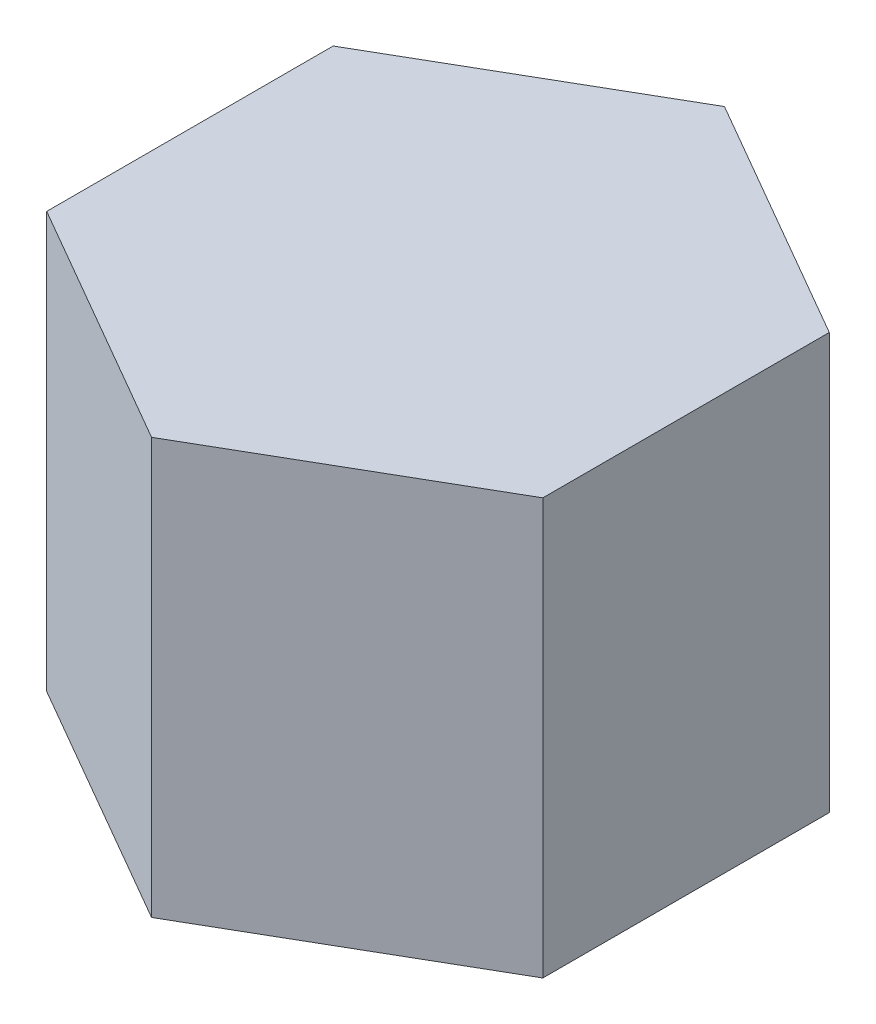
ISO-10303-21;
HEADER;
FILE_DESCRIPTION(('STEP AP214'),'2;1');
FILE_NAME('part.step','',(''),(''),'','','');
FILE_SCHEMA(('AUTOMOTIVE_DESIGN { 1 0 10303 214 1 1 1 1 }'));
ENDSEC;
DATA;
#1=APPLICATION_CONTEXT('core data for automotive mechanical design processes');
#2=APPLICATION_PROTOCOL_DEFINITION('international standard','automotive_design',2000,#1);
#3=PRODUCT_CONTEXT('',#1,'mechanical');
#4=PRODUCT('Part','Part','',(#3));
#5=PRODUCT_RELATED_PRODUCT_CATEGORY('part','',(#4));
#6=PRODUCT_DEFINITION_FORMATION('','',#4);
#7=PRODUCT_DEFINITION_CONTEXT('part definition',#1,'design');
#8=PRODUCT_DEFINITION('design','',#6,#7);
#9=PRODUCT_DEFINITION_SHAPE('','',#8);
#10=(LENGTH_UNIT() NAMED_UNIT(*) SI_UNIT(.MILLI.,.METRE.));
#11=(NAMED_UNIT(*) PLANE_ANGLE_UNIT() SI_UNIT($,.RADIAN.));
#12=(NAMED_UNIT(*) SI_UNIT($,.STERADIAN.) SOLID_ANGLE_UNIT());
#13=UNCERTAINTY_MEASURE_WITH_UNIT(LENGTH_MEASURE(1.E-05),#10,'distance_accuracy_value','');
#14=(GEOMETRIC_REPRESENTATION_CONTEXT(3) GLOBAL_UNCERTAINTY_ASSIGNED_CONTEXT((#13)) GLOBAL_UNIT_ASSIGNED_CONTEXT((#10,
#11,#12)) REPRESENTATION_CONTEXT('',''));
#15=CARTESIAN_POINT('',(0.,0.,0.));
#16=DIRECTION('',(0.,0.,1.));
#17=DIRECTION('',(1.,0.,0.));
#18=AXIS2_PLACEMENT_3D('',#15,#16,#17);
#19=CARTESIAN_POINT('',(205.142660308706,-148.537700895744,292.372996624279));
#20=DIRECTION('',(-0.499999999999909,0.,-0.866025403784491));
#21=DIRECTION('',(-0.866025403784491,0.,0.499999999999909));
#22=AXIS2_PLACEMENT_3D('',#19,#20,#21);
#23=PLANE('',#22);
#24=CARTESIAN_POINT('',(204.839551417382,-149.045793579175,292.547996624279));
#25=DIRECTION('',(0.866025403784491,0.,-0.499999999999909));
#26=VECTOR('',#25,1.);
#27=LINE('',#24,#26);
#28=CARTESIAN_POINT('',(204.839551417382,-149.045793579175,292.547996624279));
#29=VERTEX_POINT('',#28);
#30=CARTESIAN_POINT('',(205.142660308706,-149.045793579175,292.372996624279));
#31=VERTEX_POINT('',#30);
#32=EDGE_CURVE('E170',#29,#31,#27,.T.);
#33=ORIENTED_EDGE('',*,*,#32,.T.);
#34=CARTESIAN_POINT('',(205.142660308706,-148.537700895744,292.372996624279));
#35=DIRECTION('',(0.,-1.,0.));
#36=VECTOR('',#35,1.);
#37=LINE('',#34,#36);
#38=CARTESIAN_POINT('',(205.142660308706,-148.537700895744,292.372996624279));
#39=VERTEX_POINT('',#38);
#40=EDGE_CURVE('E35',#39,#31,#37,.T.);
#41=ORIENTED_EDGE('',*,*,#40,.F.);
#42=CARTESIAN_POINT('',(204.839551417382,-148.537700895744,292.547996624279));
#43=DIRECTION('',(0.866025403784491,0.,-0.499999999999909));
#44=VECTOR('',#43,1.);
#45=LINE('',#42,#44);
#46=CARTESIAN_POINT('',(204.839551417382,-148.537700895744,292.547996624279));
#47=VERTEX_POINT('',#46);
#48=EDGE_CURVE('E159',#47,#39,#45,.T.);
#49=ORIENTED_EDGE('',*,*,#48,.F.);
#50=CARTESIAN_POINT('',(204.839551417382,-148.537700895744,292.547996624279));
#51=DIRECTION('',(0.,-1.,0.));
#52=VECTOR('',#51,1.);
#53=LINE('',#50,#52);
#54=EDGE_CURVE('E10',#47,#29,#53,.T.);
#55=ORIENTED_EDGE('',*,*,#54,.T.);
#56=EDGE_LOOP('',(#33,#41,#49,#55));
#57=FACE_BOUND('',#56,.T.);
#58=ADVANCED_FACE('F16',(#57),#23,.F.);
#59=CARTESIAN_POINT('',(204.839551417382,-148.537700895744,292.547996624279));
#60=DIRECTION('',(0.500000000000062,0.,-0.866025403784403));
#61=DIRECTION('',(-0.866025403784403,0.,-0.500000000000062));
#62=AXIS2_PLACEMENT_3D('',#59,#60,#61);
#63=PLANE('',#62);
#64=CARTESIAN_POINT('',(204.536442526057,-149.045793579175,292.372996624279));
#65=DIRECTION('',(0.866025403784403,0.,0.500000000000062));
#66=VECTOR('',#65,1.);
#67=LINE('',#64,#66);
#68=CARTESIAN_POINT('',(204.536442526057,-149.045793579175,292.372996624279));
#69=VERTEX_POINT('',#68);
#70=EDGE_CURVE('E167',#69,#29,#67,.T.);
#71=ORIENTED_EDGE('',*,*,#70,.T.);
#72=ORIENTED_EDGE('',*,*,#54,.F.);
#73=CARTESIAN_POINT('',(204.536442526057,-148.537700895744,292.372996624279));
#74=DIRECTION('',(0.866025403784403,0.,0.500000000000062));
#75=VECTOR('',#74,1.);
#76=LINE('',#73,#75);
#77=CARTESIAN_POINT('',(204.536442526057,-148.537700895744,292.372996624279));
#78=VERTEX_POINT('',#77);
#79=EDGE_CURVE('E156',#78,#47,#76,.T.);
#80=ORIENTED_EDGE('',*,*,#79,.F.);
#81=CARTESIAN_POINT('',(204.536442526057,-148.537700895744,292.372996624279));
#82=DIRECTION('',(0.,-1.,0.));
#83=VECTOR('',#82,1.);
#84=LINE('',#81,#83);
#85=EDGE_CURVE('E27',#78,#69,#84,.T.);
#86=ORIENTED_EDGE('',*,*,#85,.T.);
#87=EDGE_LOOP('',(#71,#72,#80,#86));
#88=FACE_BOUND('',#87,.T.);
#89=ADVANCED_FACE('F189',(#88),#63,.F.);
#90=CARTESIAN_POINT('',(204.536442526057,-148.537700895744,290.831971220494));
#91=DIRECTION('',(1.,0.,0.));
#92=DIRECTION('',(0.,1.,0.));
#93=AXIS2_PLACEMENT_3D('',#90,#91,#92);
#94=PLANE('',#93);
#95=CARTESIAN_POINT('',(204.536442526057,-149.045793579175,292.022996624279));
#96=DIRECTION('',(0.,0.,1.));
#97=VECTOR('',#96,1.);
#98=LINE('',#95,#97);
#99=CARTESIAN_POINT('',(204.536442526057,-149.045793579175,292.022996624279));
#100=VERTEX_POINT('',#99);
#101=EDGE_CURVE('E163',#100,#69,#98,.T.);
#102=ORIENTED_EDGE('',*,*,#101,.T.);
#103=ORIENTED_EDGE('',*,*,#85,.F.);
#104=CARTESIAN_POINT('',(204.536442526057,-148.537700895744,292.022996624279));
#105=DIRECTION('',(0.,0.,1.));
#106=VECTOR('',#105,1.);
#107=LINE('',#104,#106);
#108=CARTESIAN_POINT('',(204.536442526057,-148.537700895744,292.022996624279));
#109=VERTEX_POINT('',#108);
#110=EDGE_CURVE('E106',#109,#78,#107,.T.);
#111=ORIENTED_EDGE('',*,*,#110,.F.);
#112=CARTESIAN_POINT('',(204.536442526057,-148.537700895744,292.022996624279));
#113=DIRECTION('',(0.,-1.,0.));
#114=VECTOR('',#113,1.);
#115=LINE('',#112,#114);
#116=EDGE_CURVE('E94',#109,#100,#115,.T.);
#117=ORIENTED_EDGE('',*,*,#116,.T.);
#118=EDGE_LOOP('',(#102,#103,#111,#117));
#119=FACE_BOUND('',#118,.T.);
#120=ADVANCED_FACE('F198',(#119),#94,.F.);
#121=CARTESIAN_POINT('',(204.536442526057,-148.537700895744,292.022996624279));
#122=DIRECTION('',(0.499999999999943,0.,0.866025403784472));
#123=DIRECTION('',(0.866025403784472,0.,-0.499999999999943));
#124=AXIS2_PLACEMENT_3D('',#121,#122,#123);
#125=PLANE('',#124);
#126=CARTESIAN_POINT('',(204.839551417382,-149.045793579175,291.847996624279));
#127=DIRECTION('',(-0.866025403784471,0.,0.499999999999943));
#128=VECTOR('',#127,1.);
#129=LINE('',#126,#128);
#130=CARTESIAN_POINT('',(204.839551417382,-149.045793579175,291.847996624279));
#131=VERTEX_POINT('',#130);
#132=EDGE_CURVE('E162',#131,#100,#129,.T.);
#133=ORIENTED_EDGE('',*,*,#132,.T.);
#134=ORIENTED_EDGE('',*,*,#116,.F.);
#135=CARTESIAN_POINT('',(204.839551417382,-148.537700895744,291.847996624279));
#136=DIRECTION('',(-0.866025403784471,0.,0.499999999999943));
#137=VECTOR('',#136,1.);
#138=LINE('',#135,#137);
#139=CARTESIAN_POINT('',(204.839551417382,-148.537700895744,291.847996624279));
#140=VERTEX_POINT('',#139);
#141=EDGE_CURVE('E98',#140,#109,#138,.T.);
#142=ORIENTED_EDGE('',*,*,#141,.F.);
#143=CARTESIAN_POINT('',(204.839551417382,-148.537700895744,291.847996624279));
#144=DIRECTION('',(0.,-1.,0.));
#145=VECTOR('',#144,1.);
#146=LINE('',#143,#145);
#147=EDGE_CURVE('E79',#140,#131,#146,.T.);
#148=ORIENTED_EDGE('',*,*,#147,.T.);
#149=EDGE_LOOP('',(#133,#134,#142,#148));
#150=FACE_BOUND('',#149,.T.);
#151=ADVANCED_FACE('F100',(#150),#125,.F.);
#152=CARTESIAN_POINT('',(204.839551417382,-148.537700895744,291.847996624279));
#153=DIRECTION('',(-0.500000000000096,0.,0.866025403784383));
#154=DIRECTION('',(0.866025403784383,0.,0.500000000000096));
#155=AXIS2_PLACEMENT_3D('',#152,#153,#154);
#156=PLANE('',#155);
#157=CARTESIAN_POINT('',(205.142660308706,-149.045793579175,292.022996624279));
#158=DIRECTION('',(-0.866025403784383,0.,-0.500000000000096));
#159=VECTOR('',#158,1.);
#160=LINE('',#157,#159);
#161=CARTESIAN_POINT('',(205.142660308706,-149.045793579175,292.022996624279));
#162=VERTEX_POINT('',#161);
#163=EDGE_CURVE('E88',#162,#131,#160,.T.);
#164=ORIENTED_EDGE('',*,*,#163,.T.);
#165=ORIENTED_EDGE('',*,*,#147,.F.);
#166=CARTESIAN_POINT('',(205.142660308706,-148.537700895744,292.022996624279));
#167=DIRECTION('',(-0.866025403784383,0.,-0.500000000000096));
#168=VECTOR('',#167,1.);
#169=LINE('',#166,#168);
#170=CARTESIAN_POINT('',(205.142660308706,-148.537700895744,292.022996624279));
#171=VERTEX_POINT('',#170);
#172=EDGE_CURVE('E84',#171,#140,#169,.T.);
#173=ORIENTED_EDGE('',*,*,#172,.F.);
#174=CARTESIAN_POINT('',(205.142660308706,-148.537700895744,292.022996624279));
#175=DIRECTION('',(0.,-1.,0.));
#176=VECTOR('',#175,1.);
#177=LINE('',#174,#176);
#178=EDGE_CURVE('E58',#171,#162,#177,.T.);
#179=ORIENTED_EDGE('',*,*,#178,.T.);
#180=EDGE_LOOP('',(#164,#165,#173,#179));
#181=FACE_BOUND('',#180,.T.);
#182=ADVANCED_FACE('F82',(#181),#156,.F.);
#183=CARTESIAN_POINT('',(205.142660308706,-148.537700895744,290.831971220494));
#184=DIRECTION('',(-1.,0.,0.));
#185=DIRECTION('',(0.,-1.,0.));
#186=AXIS2_PLACEMENT_3D('',#183,#184,#185);
#187=PLANE('',#186);
#188=CARTESIAN_POINT('',(205.142660308706,-149.045793579175,292.372996624279));
#189=DIRECTION('',(0.,0.,-1.));
#190=VECTOR('',#189,1.);
#191=LINE('',#188,#190);
#192=EDGE_CURVE('E160',#31,#162,#191,.T.);
#193=ORIENTED_EDGE('',*,*,#192,.T.);
#194=ORIENTED_EDGE('',*,*,#178,.F.);
#195=CARTESIAN_POINT('',(205.142660308706,-148.537700895744,292.372996624279));
#196=DIRECTION('',(0.,0.,-1.));
#197=VECTOR('',#196,1.);
#198=LINE('',#195,#197);
#199=EDGE_CURVE('E112',#39,#171,#198,.T.);
#200=ORIENTED_EDGE('',*,*,#199,.F.);
#201=ORIENTED_EDGE('',*,*,#40,.T.);
#202=EDGE_LOOP('',(#193,#194,#200,#201));
#203=FACE_BOUND('',#202,.T.);
#204=ADVANCED_FACE('F131',(#203),#187,.F.);
#205=CARTESIAN_POINT('',(206.339551417382,-148.537700895744,290.831971220494));
#206=DIRECTION('',(0.,-1.,0.));
#207=DIRECTION('',(1.,0.,0.));
#208=AXIS2_PLACEMENT_3D('',#205,#206,#207);
#209=PLANE('',#208);
#210=ORIENTED_EDGE('',*,*,#48,.T.);
#211=ORIENTED_EDGE('',*,*,#199,.T.);
#212=ORIENTED_EDGE('',*,*,#172,.T.);
#213=ORIENTED_EDGE('',*,*,#141,.T.);
#214=ORIENTED_EDGE('',*,*,#110,.T.);
#215=ORIENTED_EDGE('',*,*,#79,.T.);
#216=EDGE_LOOP('',(#210,#211,#212,#213,#214,#215));
#217=FACE_BOUND('',#216,.T.);
#218=ADVANCED_FACE('F111',(#217),#209,.F.);
#219=CARTESIAN_POINT('',(206.339551417382,-149.045793579175,290.831971220494));
#220=DIRECTION('',(0.,-1.,0.));
#221=DIRECTION('',(1.,0.,0.));
#222=AXIS2_PLACEMENT_3D('',#219,#220,#221);
#223=PLANE('',#222);
#224=ORIENTED_EDGE('',*,*,#32,.F.);
#225=ORIENTED_EDGE('',*,*,#70,.F.);
#226=ORIENTED_EDGE('',*,*,#101,.F.);
#227=ORIENTED_EDGE('',*,*,#132,.F.);
#228=ORIENTED_EDGE('',*,*,#163,.F.);
#229=ORIENTED_EDGE('',*,*,#192,.F.);
#230=EDGE_LOOP('',(#224,#225,#226,#227,#228,#229));
#231=FACE_BOUND('',#230,.T.);
#232=ADVANCED_FACE('F130',(#231),#223,.T.);
#233=CLOSED_SHELL('',(#58,#89,#120,#151,#182,#204,#218,#232));
#234=MANIFOLD_SOLID_BREP('B1',#233);
#235=ADVANCED_BREP_SHAPE_REPRESENTATION('',(#18,#234),#14);
#236=SHAPE_DEFINITION_REPRESENTATION(#9,#235);
ENDSEC;
END-ISO-10303-21;
